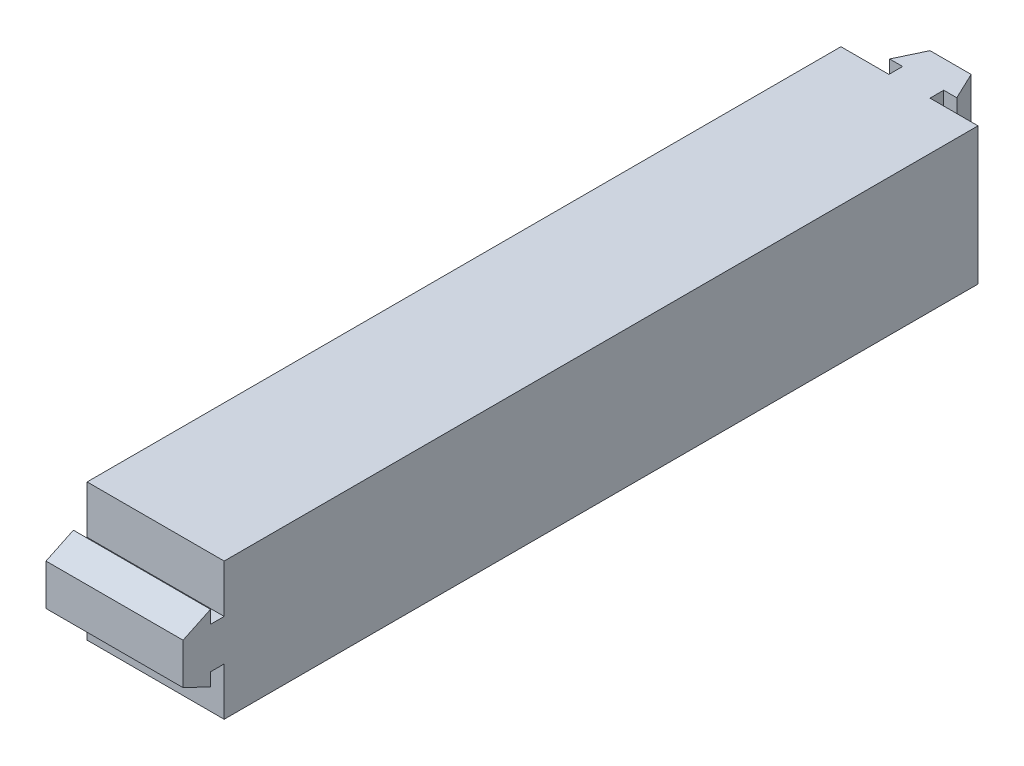
ISO-10303-21;
HEADER;
FILE_DESCRIPTION(('STEP AP214'),'2;1');
FILE_NAME('part.step','',(''),(''),'','','');
FILE_SCHEMA(('AUTOMOTIVE_DESIGN { 1 0 10303 214 1 1 1 1 }'));
ENDSEC;
DATA;
#1=APPLICATION_CONTEXT('core data for automotive mechanical design processes');
#2=APPLICATION_PROTOCOL_DEFINITION('international standard','automotive_design',2000,#1);
#3=PRODUCT_CONTEXT('',#1,'mechanical');
#4=PRODUCT('Part','Part','',(#3));
#5=PRODUCT_RELATED_PRODUCT_CATEGORY('part','',(#4));
#6=PRODUCT_DEFINITION_FORMATION('','',#4);
#7=PRODUCT_DEFINITION_CONTEXT('part definition',#1,'design');
#8=PRODUCT_DEFINITION('design','',#6,#7);
#9=PRODUCT_DEFINITION_SHAPE('','',#8);
#10=(LENGTH_UNIT() NAMED_UNIT(*) SI_UNIT(.MILLI.,.METRE.));
#11=(NAMED_UNIT(*) PLANE_ANGLE_UNIT() SI_UNIT($,.RADIAN.));
#12=(NAMED_UNIT(*) SI_UNIT($,.STERADIAN.) SOLID_ANGLE_UNIT());
#13=UNCERTAINTY_MEASURE_WITH_UNIT(LENGTH_MEASURE(1.E-05),#10,'distance_accuracy_value','');
#14=(GEOMETRIC_REPRESENTATION_CONTEXT(3) GLOBAL_UNCERTAINTY_ASSIGNED_CONTEXT((#13)) GLOBAL_UNIT_ASSIGNED_CONTEXT((#10,
#11,#12)) REPRESENTATION_CONTEXT('',''));
#15=CARTESIAN_POINT('',(0.,0.,0.));
#16=DIRECTION('',(0.,0.,1.));
#17=DIRECTION('',(1.,0.,0.));
#18=AXIS2_PLACEMENT_3D('',#15,#16,#17);
#19=CARTESIAN_POINT('',(0.,20.,-110.));
#20=DIRECTION('',(0.,0.,1.));
#21=DIRECTION('',(1.,0.,0.));
#22=AXIS2_PLACEMENT_3D('',#19,#20,#21);
#23=PLANE('',#22);
#24=DIRECTION('',(0.,1.,0.));
#25=VECTOR('',#24,1.);
#26=CARTESIAN_POINT('',(7.,-11.4908659377786,-110.));
#27=LINE('',#26,#25);
#28=CARTESIAN_POINT('',(7.,0.,-110.));
#29=VERTEX_POINT('',#28);
#30=CARTESIAN_POINT('',(7.,20.,-110.));
#31=VERTEX_POINT('',#30);
#32=EDGE_CURVE('E217',#29,#31,#27,.T.);
#33=ORIENTED_EDGE('',*,*,#32,.F.);
#34=DIRECTION('',(-1.,0.,0.));
#35=VECTOR('',#34,1.);
#36=CARTESIAN_POINT('',(0.,0.,-110.));
#37=LINE('',#36,#35);
#38=CARTESIAN_POINT('',(0.,0.,-110.));
#39=VERTEX_POINT('',#38);
#40=EDGE_CURVE('E303',#29,#39,#37,.T.);
#41=ORIENTED_EDGE('',*,*,#40,.T.);
#42=DIRECTION('',(0.,-1.,0.));
#43=VECTOR('',#42,1.);
#44=CARTESIAN_POINT('',(0.,20.,-110.));
#45=LINE('',#44,#43);
#46=CARTESIAN_POINT('',(0.,20.,-110.));
#47=VERTEX_POINT('',#46);
#48=EDGE_CURVE('E295',#47,#39,#45,.T.);
#49=ORIENTED_EDGE('',*,*,#48,.F.);
#50=DIRECTION('',(-1.,0.,0.));
#51=VECTOR('',#50,1.);
#52=CARTESIAN_POINT('',(0.,20.,-110.));
#53=LINE('',#52,#51);
#54=EDGE_CURVE('E291',#31,#47,#53,.T.);
#55=ORIENTED_EDGE('',*,*,#54,.F.);
#56=EDGE_LOOP('',(#33,#41,#49,#55));
#57=FACE_BOUND('',#56,.T.);
#58=ADVANCED_FACE('F33',(#57),#23,.F.);
#59=CARTESIAN_POINT('',(0.,20.,0.));
#60=DIRECTION('',(0.,0.,-1.));
#61=DIRECTION('',(-1.,0.,0.));
#62=AXIS2_PLACEMENT_3D('',#59,#60,#61);
#63=PLANE('',#62);
#64=DIRECTION('',(-1.,0.,0.));
#65=VECTOR('',#64,1.);
#66=CARTESIAN_POINT('',(31.4908659377786,13.,0.));
#67=LINE('',#66,#65);
#68=CARTESIAN_POINT('',(20.,13.,0.));
#69=VERTEX_POINT('',#68);
#70=CARTESIAN_POINT('',(0.,13.,0.));
#71=VERTEX_POINT('',#70);
#72=EDGE_CURVE('E273',#69,#71,#67,.T.);
#73=ORIENTED_EDGE('',*,*,#72,.F.);
#74=DIRECTION('',(0.,-1.,0.));
#75=VECTOR('',#74,1.);
#76=CARTESIAN_POINT('',(20.,20.,0.));
#77=LINE('',#76,#75);
#78=CARTESIAN_POINT('',(20.,20.,0.));
#79=VERTEX_POINT('',#78);
#80=EDGE_CURVE('E311',#79,#69,#77,.T.);
#81=ORIENTED_EDGE('',*,*,#80,.F.);
#82=DIRECTION('',(1.,0.,0.));
#83=VECTOR('',#82,1.);
#84=CARTESIAN_POINT('',(0.,20.,0.));
#85=LINE('',#84,#83);
#86=CARTESIAN_POINT('',(0.,20.,0.));
#87=VERTEX_POINT('',#86);
#88=EDGE_CURVE('E286',#87,#79,#85,.T.);
#89=ORIENTED_EDGE('',*,*,#88,.F.);
#90=DIRECTION('',(0.,-1.,0.));
#91=VECTOR('',#90,1.);
#92=CARTESIAN_POINT('',(0.,20.,0.));
#93=LINE('',#92,#91);
#94=EDGE_CURVE('E11',#87,#71,#93,.T.);
#95=ORIENTED_EDGE('',*,*,#94,.T.);
#96=EDGE_LOOP('',(#73,#81,#89,#95));
#97=FACE_BOUND('',#96,.T.);
#98=ADVANCED_FACE('F334',(#97),#63,.F.);
#99=CARTESIAN_POINT('',(0.,20.,0.));
#100=DIRECTION('',(1.,0.,0.));
#101=DIRECTION('',(0.,0.,-1.));
#102=AXIS2_PLACEMENT_3D('',#99,#100,#101);
#103=PLANE('',#102);
#104=DIRECTION('',(0.,0.,1.));
#105=VECTOR('',#104,1.);
#106=CARTESIAN_POINT('',(0.,0.,0.));
#107=LINE('',#106,#105);
#108=CARTESIAN_POINT('',(0.,0.,0.));
#109=VERTEX_POINT('',#108);
#110=EDGE_CURVE('E246',#39,#109,#107,.T.);
#111=ORIENTED_EDGE('',*,*,#110,.T.);
#112=CARTESIAN_POINT('',(0.,7.,0.));
#113=VERTEX_POINT('',#112);
#114=EDGE_CURVE('E41',#113,#109,#93,.T.);
#115=ORIENTED_EDGE('',*,*,#114,.F.);
#116=DIRECTION('',(0.,0.,-1.));
#117=VECTOR('',#116,1.);
#118=CARTESIAN_POINT('',(0.,7.,0.));
#119=LINE('',#118,#117);
#120=CARTESIAN_POINT('',(0.,7.,2.));
#121=VERTEX_POINT('',#120);
#122=EDGE_CURVE('E56',#121,#113,#119,.T.);
#123=ORIENTED_EDGE('',*,*,#122,.F.);
#124=DIRECTION('',(0.,1.,0.));
#125=VECTOR('',#124,1.);
#126=CARTESIAN_POINT('',(0.,7.,2.));
#127=LINE('',#126,#125);
#128=CARTESIAN_POINT('',(0.,5.1,2.));
#129=VERTEX_POINT('',#128);
#130=EDGE_CURVE('E249',#129,#121,#127,.T.);
#131=ORIENTED_EDGE('',*,*,#130,.F.);
#132=DIRECTION('',(0.,-0.429056814568288,-0.90327750435429));
#133=VECTOR('',#132,1.);
#134=CARTESIAN_POINT('',(0.,5.1,2.));
#135=LINE('',#134,#133);
#136=CARTESIAN_POINT('',(0.,7.,6.));
#137=VERTEX_POINT('',#136);
#138=EDGE_CURVE('E227',#137,#129,#135,.T.);
#139=ORIENTED_EDGE('',*,*,#138,.F.);
#140=DIRECTION('',(0.,-1.,0.));
#141=VECTOR('',#140,1.);
#142=CARTESIAN_POINT('',(0.,13.,6.));
#143=LINE('',#142,#141);
#144=CARTESIAN_POINT('',(0.,13.,6.));
#145=VERTEX_POINT('',#144);
#146=EDGE_CURVE('E262',#145,#137,#143,.T.);
#147=ORIENTED_EDGE('',*,*,#146,.F.);
#148=DIRECTION('',(0.,-0.429056814568288,0.90327750435429));
#149=VECTOR('',#148,1.);
#150=CARTESIAN_POINT('',(0.,14.9,2.));
#151=LINE('',#150,#149);
#152=CARTESIAN_POINT('',(0.,14.9,2.));
#153=VERTEX_POINT('',#152);
#154=EDGE_CURVE('E259',#153,#145,#151,.T.);
#155=ORIENTED_EDGE('',*,*,#154,.F.);
#156=DIRECTION('',(0.,1.,0.));
#157=VECTOR('',#156,1.);
#158=CARTESIAN_POINT('',(0.,13.,2.));
#159=LINE('',#158,#157);
#160=CARTESIAN_POINT('',(0.,13.,2.));
#161=VERTEX_POINT('',#160);
#162=EDGE_CURVE('E256',#161,#153,#159,.T.);
#163=ORIENTED_EDGE('',*,*,#162,.F.);
#164=DIRECTION('',(0.,0.,1.));
#165=VECTOR('',#164,1.);
#166=CARTESIAN_POINT('',(0.,13.,0.));
#167=LINE('',#166,#165);
#168=EDGE_CURVE('E253',#71,#161,#167,.T.);
#169=ORIENTED_EDGE('',*,*,#168,.F.);
#170=ORIENTED_EDGE('',*,*,#94,.F.);
#171=DIRECTION('',(0.,0.,1.));
#172=VECTOR('',#171,1.);
#173=CARTESIAN_POINT('',(0.,20.,0.));
#174=LINE('',#173,#172);
#175=EDGE_CURVE('E283',#47,#87,#174,.T.);
#176=ORIENTED_EDGE('',*,*,#175,.F.);
#177=ORIENTED_EDGE('',*,*,#48,.T.);
#178=EDGE_LOOP('',(#111,#115,#123,#131,#139,#147,#155,#163,#169,#170,#176,#177));
#179=FACE_BOUND('',#178,.T.);
#180=ADVANCED_FACE('F35',(#179),#103,.F.);
#181=CARTESIAN_POINT('',(20.,7.,0.));
#182=VERTEX_POINT('',#181);
#183=CARTESIAN_POINT('',(20.,0.,0.));
#184=VERTEX_POINT('',#183);
#185=EDGE_CURVE('E310',#182,#184,#77,.T.);
#186=ORIENTED_EDGE('',*,*,#185,.F.);
#187=DIRECTION('',(-1.,0.,0.));
#188=VECTOR('',#187,1.);
#189=CARTESIAN_POINT('',(31.4908659377786,7.,0.));
#190=LINE('',#189,#188);
#191=EDGE_CURVE('E275',#182,#113,#190,.T.);
#192=ORIENTED_EDGE('',*,*,#191,.T.);
#193=ORIENTED_EDGE('',*,*,#114,.T.);
#194=DIRECTION('',(1.,0.,0.));
#195=VECTOR('',#194,1.);
#196=CARTESIAN_POINT('',(0.,0.,0.));
#197=LINE('',#196,#195);
#198=EDGE_CURVE('E298',#109,#184,#197,.T.);
#199=ORIENTED_EDGE('',*,*,#198,.T.);
#200=EDGE_LOOP('',(#186,#192,#193,#199));
#201=FACE_BOUND('',#200,.T.);
#202=ADVANCED_FACE('F322',(#201),#63,.F.);
#203=CARTESIAN_POINT('',(20.,20.,0.));
#204=DIRECTION('',(-1.,0.,0.));
#205=DIRECTION('',(0.,0.,1.));
#206=AXIS2_PLACEMENT_3D('',#203,#204,#205);
#207=PLANE('',#206);
#208=DIRECTION('',(0.,0.,-1.));
#209=VECTOR('',#208,1.);
#210=CARTESIAN_POINT('',(20.,0.,0.));
#211=LINE('',#210,#209);
#212=CARTESIAN_POINT('',(20.,0.,-110.));
#213=VERTEX_POINT('',#212);
#214=EDGE_CURVE('E301',#184,#213,#211,.T.);
#215=ORIENTED_EDGE('',*,*,#214,.T.);
#216=DIRECTION('',(0.,-1.,0.));
#217=VECTOR('',#216,1.);
#218=CARTESIAN_POINT('',(20.,20.,-110.));
#219=LINE('',#218,#217);
#220=CARTESIAN_POINT('',(20.,20.,-110.));
#221=VERTEX_POINT('',#220);
#222=EDGE_CURVE('E308',#221,#213,#219,.T.);
#223=ORIENTED_EDGE('',*,*,#222,.F.);
#224=DIRECTION('',(0.,0.,-1.));
#225=VECTOR('',#224,1.);
#226=CARTESIAN_POINT('',(20.,20.,0.));
#227=LINE('',#226,#225);
#228=EDGE_CURVE('E289',#79,#221,#227,.T.);
#229=ORIENTED_EDGE('',*,*,#228,.F.);
#230=ORIENTED_EDGE('',*,*,#80,.T.);
#231=DIRECTION('',(0.,0.,-1.));
#232=VECTOR('',#231,1.);
#233=CARTESIAN_POINT('',(20.,13.,0.));
#234=LINE('',#233,#232);
#235=CARTESIAN_POINT('',(20.,13.,2.));
#236=VERTEX_POINT('',#235);
#237=EDGE_CURVE('E235',#236,#69,#234,.T.);
#238=ORIENTED_EDGE('',*,*,#237,.F.);
#239=DIRECTION('',(0.,-1.,0.));
#240=VECTOR('',#239,1.);
#241=CARTESIAN_POINT('',(20.,13.,2.));
#242=LINE('',#241,#240);
#243=CARTESIAN_POINT('',(20.,14.9,2.));
#244=VERTEX_POINT('',#243);
#245=EDGE_CURVE('E231',#244,#236,#242,.T.);
#246=ORIENTED_EDGE('',*,*,#245,.F.);
#247=DIRECTION('',(0.,0.429056814568288,-0.90327750435429));
#248=VECTOR('',#247,1.);
#249=CARTESIAN_POINT('',(20.,14.9,2.));
#250=LINE('',#249,#248);
#251=CARTESIAN_POINT('',(20.,13.,6.));
#252=VERTEX_POINT('',#251);
#253=EDGE_CURVE('E228',#252,#244,#250,.T.);
#254=ORIENTED_EDGE('',*,*,#253,.F.);
#255=DIRECTION('',(0.,1.,0.));
#256=VECTOR('',#255,1.);
#257=CARTESIAN_POINT('',(20.,13.,6.));
#258=LINE('',#257,#256);
#259=CARTESIAN_POINT('',(20.,7.,6.));
#260=VERTEX_POINT('',#259);
#261=EDGE_CURVE('E232',#260,#252,#258,.T.);
#262=ORIENTED_EDGE('',*,*,#261,.F.);
#263=DIRECTION('',(0.,0.429056814568288,0.90327750435429));
#264=VECTOR('',#263,1.);
#265=CARTESIAN_POINT('',(20.,5.1,2.));
#266=LINE('',#265,#264);
#267=CARTESIAN_POINT('',(20.,5.1,2.));
#268=VERTEX_POINT('',#267);
#269=EDGE_CURVE('E243',#268,#260,#266,.T.);
#270=ORIENTED_EDGE('',*,*,#269,.F.);
#271=DIRECTION('',(0.,-1.,0.));
#272=VECTOR('',#271,1.);
#273=CARTESIAN_POINT('',(20.,7.,2.));
#274=LINE('',#273,#272);
#275=CARTESIAN_POINT('',(20.,7.,2.));
#276=VERTEX_POINT('',#275);
#277=EDGE_CURVE('E240',#276,#268,#274,.T.);
#278=ORIENTED_EDGE('',*,*,#277,.F.);
#279=DIRECTION('',(0.,0.,1.));
#280=VECTOR('',#279,1.);
#281=CARTESIAN_POINT('',(20.,7.,0.));
#282=LINE('',#281,#280);
#283=EDGE_CURVE('E237',#182,#276,#282,.T.);
#284=ORIENTED_EDGE('',*,*,#283,.F.);
#285=ORIENTED_EDGE('',*,*,#185,.T.);
#286=EDGE_LOOP('',(#215,#223,#229,#230,#238,#246,#254,#262,#270,#278,#284,#285));
#287=FACE_BOUND('',#286,.T.);
#288=ADVANCED_FACE('F317',(#287),#207,.F.);
#289=CARTESIAN_POINT('',(13.,0.,-110.));
#290=VERTEX_POINT('',#289);
#291=EDGE_CURVE('E287',#213,#290,#37,.T.);
#292=ORIENTED_EDGE('',*,*,#291,.T.);
#293=DIRECTION('',(0.,1.,0.));
#294=VECTOR('',#293,1.);
#295=CARTESIAN_POINT('',(13.,-11.4908659377786,-110.));
#296=LINE('',#295,#294);
#297=CARTESIAN_POINT('',(13.,20.,-110.));
#298=VERTEX_POINT('',#297);
#299=EDGE_CURVE('E214',#290,#298,#296,.T.);
#300=ORIENTED_EDGE('',*,*,#299,.T.);
#301=EDGE_CURVE('E292',#221,#298,#53,.T.);
#302=ORIENTED_EDGE('',*,*,#301,.F.);
#303=ORIENTED_EDGE('',*,*,#222,.T.);
#304=EDGE_LOOP('',(#292,#300,#302,#303));
#305=FACE_BOUND('',#304,.T.);
#306=ADVANCED_FACE('F326',(#305),#23,.F.);
#307=CARTESIAN_POINT('',(0.,20.,0.));
#308=DIRECTION('',(0.,-1.,0.));
#309=DIRECTION('',(0.,0.,-1.));
#310=AXIS2_PLACEMENT_3D('',#307,#308,#309);
#311=PLANE('',#310);
#312=ORIENTED_EDGE('',*,*,#175,.T.);
#313=ORIENTED_EDGE('',*,*,#88,.T.);
#314=ORIENTED_EDGE('',*,*,#228,.T.);
#315=ORIENTED_EDGE('',*,*,#301,.T.);
#316=DIRECTION('',(0.,0.,-1.));
#317=VECTOR('',#316,1.);
#318=CARTESIAN_POINT('',(13.,20.,-110.));
#319=LINE('',#318,#317);
#320=CARTESIAN_POINT('',(13.,20.,-112.));
#321=VERTEX_POINT('',#320);
#322=EDGE_CURVE('E48',#298,#321,#319,.T.);
#323=ORIENTED_EDGE('',*,*,#322,.T.);
#324=DIRECTION('',(1.,0.,0.));
#325=VECTOR('',#324,1.);
#326=CARTESIAN_POINT('',(13.,20.,-112.));
#327=LINE('',#326,#325);
#328=CARTESIAN_POINT('',(14.9,20.,-112.));
#329=VERTEX_POINT('',#328);
#330=EDGE_CURVE('E196',#321,#329,#327,.T.);
#331=ORIENTED_EDGE('',*,*,#330,.T.);
#332=DIRECTION('',(-0.429056814568287,0.,-0.90327750435429));
#333=VECTOR('',#332,1.);
#334=CARTESIAN_POINT('',(14.9,20.,-112.));
#335=LINE('',#334,#333);
#336=CARTESIAN_POINT('',(13.,20.,-116.));
#337=VERTEX_POINT('',#336);
#338=EDGE_CURVE('E202',#329,#337,#335,.T.);
#339=ORIENTED_EDGE('',*,*,#338,.T.);
#340=DIRECTION('',(-1.,0.,0.));
#341=VECTOR('',#340,1.);
#342=CARTESIAN_POINT('',(7.,20.,-116.));
#343=LINE('',#342,#341);
#344=CARTESIAN_POINT('',(7.,20.,-116.));
#345=VERTEX_POINT('',#344);
#346=EDGE_CURVE('E379',#337,#345,#343,.T.);
#347=ORIENTED_EDGE('',*,*,#346,.T.);
#348=DIRECTION('',(-0.429056814568287,0.,0.90327750435429));
#349=VECTOR('',#348,1.);
#350=CARTESIAN_POINT('',(5.1,20.,-112.));
#351=LINE('',#350,#349);
#352=CARTESIAN_POINT('',(5.1,20.,-112.));
#353=VERTEX_POINT('',#352);
#354=EDGE_CURVE('E188',#345,#353,#351,.T.);
#355=ORIENTED_EDGE('',*,*,#354,.T.);
#356=DIRECTION('',(1.,0.,0.));
#357=VECTOR('',#356,1.);
#358=CARTESIAN_POINT('',(7.,20.,-112.));
#359=LINE('',#358,#357);
#360=CARTESIAN_POINT('',(7.,20.,-112.));
#361=VERTEX_POINT('',#360);
#362=EDGE_CURVE('E374',#353,#361,#359,.T.);
#363=ORIENTED_EDGE('',*,*,#362,.T.);
#364=DIRECTION('',(0.,0.,1.));
#365=VECTOR('',#364,1.);
#366=CARTESIAN_POINT('',(7.,20.,-110.));
#367=LINE('',#366,#365);
#368=EDGE_CURVE('E371',#361,#31,#367,.T.);
#369=ORIENTED_EDGE('',*,*,#368,.T.);
#370=ORIENTED_EDGE('',*,*,#54,.T.);
#371=EDGE_LOOP('',(#312,#313,#314,#315,#323,#331,#339,#347,#355,#363,#369,#370));
#372=FACE_BOUND('',#371,.T.);
#373=ADVANCED_FACE('F329',(#372),#311,.F.);
#374=CARTESIAN_POINT('',(0.,0.,0.));
#375=DIRECTION('',(0.,-1.,0.));
#376=DIRECTION('',(0.,0.,-1.));
#377=AXIS2_PLACEMENT_3D('',#374,#375,#376);
#378=PLANE('',#377);
#379=ORIENTED_EDGE('',*,*,#110,.F.);
#380=ORIENTED_EDGE('',*,*,#40,.F.);
#381=DIRECTION('',(0.,0.,1.));
#382=VECTOR('',#381,1.);
#383=CARTESIAN_POINT('',(7.,0.,-110.));
#384=LINE('',#383,#382);
#385=CARTESIAN_POINT('',(7.,0.,-112.));
#386=VERTEX_POINT('',#385);
#387=EDGE_CURVE('E215',#386,#29,#384,.T.);
#388=ORIENTED_EDGE('',*,*,#387,.F.);
#389=DIRECTION('',(1.,0.,0.));
#390=VECTOR('',#389,1.);
#391=CARTESIAN_POINT('',(7.,0.,-112.));
#392=LINE('',#391,#390);
#393=CARTESIAN_POINT('',(5.1,0.,-112.));
#394=VERTEX_POINT('',#393);
#395=EDGE_CURVE('E179',#394,#386,#392,.T.);
#396=ORIENTED_EDGE('',*,*,#395,.F.);
#397=DIRECTION('',(-0.429056814568287,0.,0.90327750435429));
#398=VECTOR('',#397,1.);
#399=CARTESIAN_POINT('',(5.1,0.,-112.));
#400=LINE('',#399,#398);
#401=CARTESIAN_POINT('',(7.,0.,-116.));
#402=VERTEX_POINT('',#401);
#403=EDGE_CURVE('E171',#402,#394,#400,.T.);
#404=ORIENTED_EDGE('',*,*,#403,.F.);
#405=DIRECTION('',(-1.,0.,0.));
#406=VECTOR('',#405,1.);
#407=CARTESIAN_POINT('',(7.,0.,-116.));
#408=LINE('',#407,#406);
#409=CARTESIAN_POINT('',(13.,0.,-116.));
#410=VERTEX_POINT('',#409);
#411=EDGE_CURVE('E176',#410,#402,#408,.T.);
#412=ORIENTED_EDGE('',*,*,#411,.F.);
#413=DIRECTION('',(-0.429056814568287,0.,-0.90327750435429));
#414=VECTOR('',#413,1.);
#415=CARTESIAN_POINT('',(14.9,0.,-112.));
#416=LINE('',#415,#414);
#417=CARTESIAN_POINT('',(14.9,0.,-112.));
#418=VERTEX_POINT('',#417);
#419=EDGE_CURVE('E204',#418,#410,#416,.T.);
#420=ORIENTED_EDGE('',*,*,#419,.F.);
#421=DIRECTION('',(1.,0.,0.));
#422=VECTOR('',#421,1.);
#423=CARTESIAN_POINT('',(13.,0.,-112.));
#424=LINE('',#423,#422);
#425=CARTESIAN_POINT('',(13.,0.,-112.));
#426=VERTEX_POINT('',#425);
#427=EDGE_CURVE('E207',#426,#418,#424,.T.);
#428=ORIENTED_EDGE('',*,*,#427,.F.);
#429=DIRECTION('',(0.,0.,-1.));
#430=VECTOR('',#429,1.);
#431=CARTESIAN_POINT('',(13.,0.,-110.));
#432=LINE('',#431,#430);
#433=EDGE_CURVE('E211',#290,#426,#432,.T.);
#434=ORIENTED_EDGE('',*,*,#433,.F.);
#435=ORIENTED_EDGE('',*,*,#291,.F.);
#436=ORIENTED_EDGE('',*,*,#214,.F.);
#437=ORIENTED_EDGE('',*,*,#198,.F.);
#438=EDGE_LOOP('',(#379,#380,#388,#396,#404,#412,#420,#428,#434,#435,#436,#437));
#439=FACE_BOUND('',#438,.T.);
#440=ADVANCED_FACE('F174',(#439),#378,.T.);
#441=CARTESIAN_POINT('',(31.4908659377786,13.,6.));
#442=DIRECTION('',(0.,0.,-1.));
#443=DIRECTION('',(0.,1.,0.));
#444=AXIS2_PLACEMENT_3D('',#441,#442,#443);
#445=PLANE('',#444);
#446=DIRECTION('',(-1.,0.,0.));
#447=VECTOR('',#446,1.);
#448=CARTESIAN_POINT('',(31.4908659377786,7.,6.));
#449=LINE('',#448,#447);
#450=EDGE_CURVE('E265',#260,#137,#449,.T.);
#451=ORIENTED_EDGE('',*,*,#450,.F.);
#452=ORIENTED_EDGE('',*,*,#261,.T.);
#453=DIRECTION('',(-1.,0.,0.));
#454=VECTOR('',#453,1.);
#455=CARTESIAN_POINT('',(31.4908659377786,13.,6.));
#456=LINE('',#455,#454);
#457=EDGE_CURVE('E267',#252,#145,#456,.T.);
#458=ORIENTED_EDGE('',*,*,#457,.T.);
#459=ORIENTED_EDGE('',*,*,#146,.T.);
#460=EDGE_LOOP('',(#451,#452,#458,#459));
#461=FACE_BOUND('',#460,.T.);
#462=ADVANCED_FACE('F351',(#461),#445,.F.);
#463=CARTESIAN_POINT('',(31.4908659377786,14.9,2.));
#464=DIRECTION('',(0.,-0.90327750435429,-0.429056814568288));
#465=DIRECTION('',(0.,0.429056814568288,-0.90327750435429));
#466=AXIS2_PLACEMENT_3D('',#463,#464,#465);
#467=PLANE('',#466);
#468=ORIENTED_EDGE('',*,*,#457,.F.);
#469=ORIENTED_EDGE('',*,*,#253,.T.);
#470=DIRECTION('',(-1.,0.,0.));
#471=VECTOR('',#470,1.);
#472=CARTESIAN_POINT('',(31.4908659377786,14.9,2.));
#473=LINE('',#472,#471);
#474=EDGE_CURVE('E269',#244,#153,#473,.T.);
#475=ORIENTED_EDGE('',*,*,#474,.T.);
#476=ORIENTED_EDGE('',*,*,#154,.T.);
#477=EDGE_LOOP('',(#468,#469,#475,#476));
#478=FACE_BOUND('',#477,.T.);
#479=ADVANCED_FACE('F348',(#478),#467,.F.);
#480=CARTESIAN_POINT('',(31.4908659377786,13.,2.));
#481=DIRECTION('',(0.,0.,1.));
#482=DIRECTION('',(0.,-1.,0.));
#483=AXIS2_PLACEMENT_3D('',#480,#481,#482);
#484=PLANE('',#483);
#485=ORIENTED_EDGE('',*,*,#474,.F.);
#486=ORIENTED_EDGE('',*,*,#245,.T.);
#487=DIRECTION('',(-1.,0.,0.));
#488=VECTOR('',#487,1.);
#489=CARTESIAN_POINT('',(31.4908659377786,13.,2.));
#490=LINE('',#489,#488);
#491=EDGE_CURVE('E271',#236,#161,#490,.T.);
#492=ORIENTED_EDGE('',*,*,#491,.T.);
#493=ORIENTED_EDGE('',*,*,#162,.T.);
#494=EDGE_LOOP('',(#485,#486,#492,#493));
#495=FACE_BOUND('',#494,.T.);
#496=ADVANCED_FACE('F345',(#495),#484,.F.);
#497=CARTESIAN_POINT('',(31.4908659377786,13.,0.));
#498=DIRECTION('',(0.,-1.,0.));
#499=DIRECTION('',(0.,0.,-1.));
#500=AXIS2_PLACEMENT_3D('',#497,#498,#499);
#501=PLANE('',#500);
#502=ORIENTED_EDGE('',*,*,#491,.F.);
#503=ORIENTED_EDGE('',*,*,#237,.T.);
#504=ORIENTED_EDGE('',*,*,#72,.T.);
#505=ORIENTED_EDGE('',*,*,#168,.T.);
#506=EDGE_LOOP('',(#502,#503,#504,#505));
#507=FACE_BOUND('',#506,.T.);
#508=ADVANCED_FACE('F338',(#507),#501,.F.);
#509=CARTESIAN_POINT('',(31.4908659377786,7.,0.));
#510=DIRECTION('',(0.,1.,0.));
#511=DIRECTION('',(0.,0.,1.));
#512=AXIS2_PLACEMENT_3D('',#509,#510,#511);
#513=PLANE('',#512);
#514=ORIENTED_EDGE('',*,*,#191,.F.);
#515=ORIENTED_EDGE('',*,*,#283,.T.);
#516=DIRECTION('',(-1.,0.,0.));
#517=VECTOR('',#516,1.);
#518=CARTESIAN_POINT('',(31.4908659377786,7.,2.));
#519=LINE('',#518,#517);
#520=EDGE_CURVE('E277',#276,#121,#519,.T.);
#521=ORIENTED_EDGE('',*,*,#520,.T.);
#522=ORIENTED_EDGE('',*,*,#122,.T.);
#523=EDGE_LOOP('',(#514,#515,#521,#522));
#524=FACE_BOUND('',#523,.T.);
#525=ADVANCED_FACE('F360',(#524),#513,.F.);
#526=CARTESIAN_POINT('',(31.4908659377786,7.,2.));
#527=DIRECTION('',(0.,0.,1.));
#528=DIRECTION('',(0.,-1.,0.));
#529=AXIS2_PLACEMENT_3D('',#526,#527,#528);
#530=PLANE('',#529);
#531=ORIENTED_EDGE('',*,*,#520,.F.);
#532=ORIENTED_EDGE('',*,*,#277,.T.);
#533=DIRECTION('',(-1.,0.,0.));
#534=VECTOR('',#533,1.);
#535=CARTESIAN_POINT('',(31.4908659377786,5.1,2.));
#536=LINE('',#535,#534);
#537=EDGE_CURVE('E279',#268,#129,#536,.T.);
#538=ORIENTED_EDGE('',*,*,#537,.T.);
#539=ORIENTED_EDGE('',*,*,#130,.T.);
#540=EDGE_LOOP('',(#531,#532,#538,#539));
#541=FACE_BOUND('',#540,.T.);
#542=ADVANCED_FACE('F358',(#541),#530,.F.);
#543=CARTESIAN_POINT('',(31.4908659377786,5.1,2.));
#544=DIRECTION('',(0.,0.90327750435429,-0.429056814568288));
#545=DIRECTION('',(0.,0.429056814568288,0.90327750435429));
#546=AXIS2_PLACEMENT_3D('',#543,#544,#545);
#547=PLANE('',#546);
#548=ORIENTED_EDGE('',*,*,#537,.F.);
#549=ORIENTED_EDGE('',*,*,#269,.T.);
#550=ORIENTED_EDGE('',*,*,#450,.T.);
#551=ORIENTED_EDGE('',*,*,#138,.T.);
#552=EDGE_LOOP('',(#548,#549,#550,#551));
#553=FACE_BOUND('',#552,.T.);
#554=ADVANCED_FACE('F355',(#553),#547,.F.);
#555=CARTESIAN_POINT('',(7.,-11.4908659377786,-116.));
#556=DIRECTION('',(0.,0.,-1.));
#557=DIRECTION('',(-1.,0.,0.));
#558=AXIS2_PLACEMENT_3D('',#555,#556,#557);
#559=PLANE('',#558);
#560=DIRECTION('',(0.,1.,0.));
#561=VECTOR('',#560,1.);
#562=CARTESIAN_POINT('',(13.,-11.4908659377786,-116.));
#563=LINE('',#562,#561);
#564=EDGE_CURVE('E195',#410,#337,#563,.T.);
#565=ORIENTED_EDGE('',*,*,#564,.F.);
#566=ORIENTED_EDGE('',*,*,#411,.T.);
#567=DIRECTION('',(0.,1.,0.));
#568=VECTOR('',#567,1.);
#569=CARTESIAN_POINT('',(7.,-11.4908659377786,-116.));
#570=LINE('',#569,#568);
#571=EDGE_CURVE('E183',#402,#345,#570,.T.);
#572=ORIENTED_EDGE('',*,*,#571,.T.);
#573=ORIENTED_EDGE('',*,*,#346,.F.);
#574=EDGE_LOOP('',(#565,#566,#572,#573));
#575=FACE_BOUND('',#574,.T.);
#576=ADVANCED_FACE('F194',(#575),#559,.T.);
#577=CARTESIAN_POINT('',(5.1,-11.4908659377786,-112.));
#578=DIRECTION('',(-0.90327750435429,0.,-0.429056814568287));
#579=DIRECTION('',(-0.429056814568287,0.,0.90327750435429));
#580=AXIS2_PLACEMENT_3D('',#577,#578,#579);
#581=PLANE('',#580);
#582=ORIENTED_EDGE('',*,*,#571,.F.);
#583=ORIENTED_EDGE('',*,*,#403,.T.);
#584=DIRECTION('',(0.,1.,0.));
#585=VECTOR('',#584,1.);
#586=CARTESIAN_POINT('',(5.1,-11.4908659377786,-112.));
#587=LINE('',#586,#585);
#588=EDGE_CURVE('E182',#394,#353,#587,.T.);
#589=ORIENTED_EDGE('',*,*,#588,.T.);
#590=ORIENTED_EDGE('',*,*,#354,.F.);
#591=EDGE_LOOP('',(#582,#583,#589,#590));
#592=FACE_BOUND('',#591,.T.);
#593=ADVANCED_FACE('F186',(#592),#581,.T.);
#594=CARTESIAN_POINT('',(7.,-11.4908659377786,-112.));
#595=DIRECTION('',(0.,0.,1.));
#596=DIRECTION('',(1.,0.,0.));
#597=AXIS2_PLACEMENT_3D('',#594,#595,#596);
#598=PLANE('',#597);
#599=ORIENTED_EDGE('',*,*,#588,.F.);
#600=ORIENTED_EDGE('',*,*,#395,.T.);
#601=DIRECTION('',(0.,1.,0.));
#602=VECTOR('',#601,1.);
#603=CARTESIAN_POINT('',(7.,-11.4908659377786,-112.));
#604=LINE('',#603,#602);
#605=EDGE_CURVE('E218',#386,#361,#604,.T.);
#606=ORIENTED_EDGE('',*,*,#605,.T.);
#607=ORIENTED_EDGE('',*,*,#362,.F.);
#608=EDGE_LOOP('',(#599,#600,#606,#607));
#609=FACE_BOUND('',#608,.T.);
#610=ADVANCED_FACE('F397',(#609),#598,.T.);
#611=CARTESIAN_POINT('',(7.,-11.4908659377786,-110.));
#612=DIRECTION('',(-1.,0.,0.));
#613=DIRECTION('',(0.,0.,1.));
#614=AXIS2_PLACEMENT_3D('',#611,#612,#613);
#615=PLANE('',#614);
#616=ORIENTED_EDGE('',*,*,#605,.F.);
#617=ORIENTED_EDGE('',*,*,#387,.T.);
#618=ORIENTED_EDGE('',*,*,#32,.T.);
#619=ORIENTED_EDGE('',*,*,#368,.F.);
#620=EDGE_LOOP('',(#616,#617,#618,#619));
#621=FACE_BOUND('',#620,.T.);
#622=ADVANCED_FACE('F370',(#621),#615,.T.);
#623=CARTESIAN_POINT('',(13.,-11.4908659377786,-110.));
#624=DIRECTION('',(1.,0.,0.));
#625=DIRECTION('',(0.,0.,-1.));
#626=AXIS2_PLACEMENT_3D('',#623,#624,#625);
#627=PLANE('',#626);
#628=ORIENTED_EDGE('',*,*,#299,.F.);
#629=ORIENTED_EDGE('',*,*,#433,.T.);
#630=DIRECTION('',(0.,1.,0.));
#631=VECTOR('',#630,1.);
#632=CARTESIAN_POINT('',(13.,-11.4908659377786,-112.));
#633=LINE('',#632,#631);
#634=EDGE_CURVE('E210',#426,#321,#633,.T.);
#635=ORIENTED_EDGE('',*,*,#634,.T.);
#636=ORIENTED_EDGE('',*,*,#322,.F.);
#637=EDGE_LOOP('',(#628,#629,#635,#636));
#638=FACE_BOUND('',#637,.T.);
#639=ADVANCED_FACE('F389',(#638),#627,.T.);
#640=CARTESIAN_POINT('',(13.,-11.4908659377786,-112.));
#641=DIRECTION('',(0.,0.,1.));
#642=DIRECTION('',(1.,0.,0.));
#643=AXIS2_PLACEMENT_3D('',#640,#641,#642);
#644=PLANE('',#643);
#645=ORIENTED_EDGE('',*,*,#634,.F.);
#646=ORIENTED_EDGE('',*,*,#427,.T.);
#647=DIRECTION('',(0.,1.,0.));
#648=VECTOR('',#647,1.);
#649=CARTESIAN_POINT('',(14.9,-11.4908659377786,-112.));
#650=LINE('',#649,#648);
#651=EDGE_CURVE('E206',#418,#329,#650,.T.);
#652=ORIENTED_EDGE('',*,*,#651,.T.);
#653=ORIENTED_EDGE('',*,*,#330,.F.);
#654=EDGE_LOOP('',(#645,#646,#652,#653));
#655=FACE_BOUND('',#654,.T.);
#656=ADVANCED_FACE('F388',(#655),#644,.T.);
#657=CARTESIAN_POINT('',(14.9,-11.4908659377786,-112.));
#658=DIRECTION('',(0.90327750435429,0.,-0.429056814568287));
#659=DIRECTION('',(-0.429056814568287,0.,-0.90327750435429));
#660=AXIS2_PLACEMENT_3D('',#657,#658,#659);
#661=PLANE('',#660);
#662=ORIENTED_EDGE('',*,*,#651,.F.);
#663=ORIENTED_EDGE('',*,*,#419,.T.);
#664=ORIENTED_EDGE('',*,*,#564,.T.);
#665=ORIENTED_EDGE('',*,*,#338,.F.);
#666=EDGE_LOOP('',(#662,#663,#664,#665));
#667=FACE_BOUND('',#666,.T.);
#668=ADVANCED_FACE('F385',(#667),#661,.T.);
#669=CLOSED_SHELL('',(#58,#98,#180,#202,#288,#306,#373,#440,#462,#479,#496,#508,#525,#542,#554,
#576,#593,#610,#622,#639,#656,#668));
#670=MANIFOLD_SOLID_BREP('B2',#669);
#671=ADVANCED_BREP_SHAPE_REPRESENTATION('',(#18,#670),#14);
#672=SHAPE_DEFINITION_REPRESENTATION(#9,#671);
ENDSEC;
END-ISO-10303-21;
